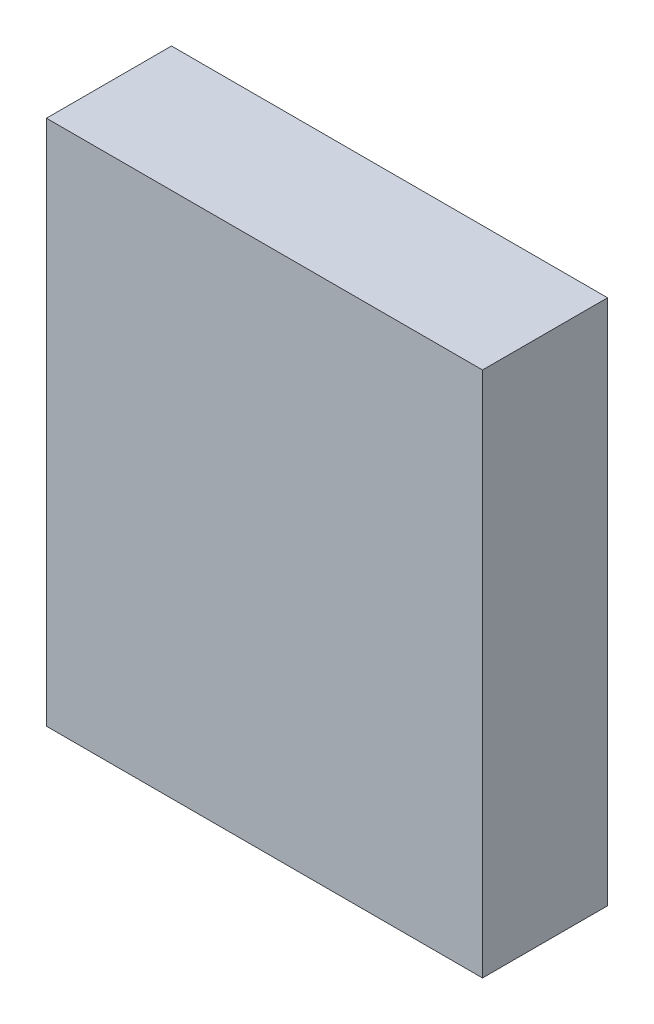
ISO-10303-21;
HEADER;
FILE_DESCRIPTION(('STEP AP214'),'2;1');
FILE_NAME('part.step','',(''),(''),'','','');
FILE_SCHEMA(('AUTOMOTIVE_DESIGN { 1 0 10303 214 1 1 1 1 }'));
ENDSEC;
DATA;
#1=APPLICATION_CONTEXT('core data for automotive mechanical design processes');
#2=APPLICATION_PROTOCOL_DEFINITION('international standard','automotive_design',2000,#1);
#3=PRODUCT_CONTEXT('',#1,'mechanical');
#4=PRODUCT('Part','Part','',(#3));
#5=PRODUCT_RELATED_PRODUCT_CATEGORY('part','',(#4));
#6=PRODUCT_DEFINITION_FORMATION('','',#4);
#7=PRODUCT_DEFINITION_CONTEXT('part definition',#1,'design');
#8=PRODUCT_DEFINITION('design','',#6,#7);
#9=PRODUCT_DEFINITION_SHAPE('','',#8);
#10=(LENGTH_UNIT() NAMED_UNIT(*) SI_UNIT(.MILLI.,.METRE.));
#11=(NAMED_UNIT(*) PLANE_ANGLE_UNIT() SI_UNIT($,.RADIAN.));
#12=(NAMED_UNIT(*) SI_UNIT($,.STERADIAN.) SOLID_ANGLE_UNIT());
#13=UNCERTAINTY_MEASURE_WITH_UNIT(LENGTH_MEASURE(1.E-05),#10,'distance_accuracy_value','');
#14=(GEOMETRIC_REPRESENTATION_CONTEXT(3) GLOBAL_UNCERTAINTY_ASSIGNED_CONTEXT((#13)) GLOBAL_UNIT_ASSIGNED_CONTEXT((#10,
#11,#12)) REPRESENTATION_CONTEXT('',''));
#15=CARTESIAN_POINT('',(0.,0.,0.));
#16=DIRECTION('',(0.,0.,1.));
#17=DIRECTION('',(1.,0.,0.));
#18=AXIS2_PLACEMENT_3D('',#15,#16,#17);
#19=CARTESIAN_POINT('',(1.32500116,1.59999934,0.76000102));
#20=DIRECTION('',(0.,0.,1.));
#21=DIRECTION('',(1.,0.,0.));
#22=AXIS2_PLACEMENT_3D('',#19,#20,#21);
#23=PLANE('',#22);
#24=DIRECTION('',(0.,-1.,0.));
#25=VECTOR('',#24,1.);
#26=CARTESIAN_POINT('',(1.32500116,1.59999934,0.76000102));
#27=LINE('',#26,#25);
#28=CARTESIAN_POINT('',(1.32500116,1.59999934,0.76000102));
#29=VERTEX_POINT('',#28);
#30=CARTESIAN_POINT('',(1.32500116,-1.59999934,0.76000102));
#31=VERTEX_POINT('',#30);
#32=EDGE_CURVE('E82',#29,#31,#27,.T.);
#33=ORIENTED_EDGE('',*,*,#32,.F.);
#34=DIRECTION('',(1.,0.,0.));
#35=VECTOR('',#34,1.);
#36=CARTESIAN_POINT('',(-1.32499862,1.59999934,0.76000102));
#37=LINE('',#36,#35);
#38=CARTESIAN_POINT('',(-1.32499862,1.59999934,0.76000102));
#39=VERTEX_POINT('',#38);
#40=EDGE_CURVE('E28',#39,#29,#37,.T.);
#41=ORIENTED_EDGE('',*,*,#40,.F.);
#42=DIRECTION('',(0.,1.,0.));
#43=VECTOR('',#42,1.);
#44=CARTESIAN_POINT('',(-1.32499862,-1.59999934,0.76000102));
#45=LINE('',#44,#43);
#46=CARTESIAN_POINT('',(-1.32499862,-1.59999934,0.76000102));
#47=VERTEX_POINT('',#46);
#48=EDGE_CURVE('E95',#47,#39,#45,.T.);
#49=ORIENTED_EDGE('',*,*,#48,.F.);
#50=DIRECTION('',(-1.,0.,0.));
#51=VECTOR('',#50,1.);
#52=CARTESIAN_POINT('',(1.32500116,-1.59999934,0.76000102));
#53=LINE('',#52,#51);
#54=EDGE_CURVE('E77',#31,#47,#53,.T.);
#55=ORIENTED_EDGE('',*,*,#54,.F.);
#56=EDGE_LOOP('',(#33,#41,#49,#55));
#57=FACE_BOUND('',#56,.T.);
#58=ADVANCED_FACE('F17',(#57),#23,.T.);
#59=CARTESIAN_POINT('',(1.32500116,1.59999934,0.));
#60=DIRECTION('',(0.,0.,1.));
#61=DIRECTION('',(1.,0.,0.));
#62=AXIS2_PLACEMENT_3D('',#59,#60,#61);
#63=PLANE('',#62);
#64=DIRECTION('',(0.,-1.,0.));
#65=VECTOR('',#64,1.);
#66=CARTESIAN_POINT('',(1.32500116,1.59999934,0.));
#67=LINE('',#66,#65);
#68=CARTESIAN_POINT('',(1.32500116,1.59999934,0.));
#69=VERTEX_POINT('',#68);
#70=CARTESIAN_POINT('',(1.32500116,-1.59999934,0.));
#71=VERTEX_POINT('',#70);
#72=EDGE_CURVE('E67',#69,#71,#67,.T.);
#73=ORIENTED_EDGE('',*,*,#72,.T.);
#74=DIRECTION('',(-1.,0.,0.));
#75=VECTOR('',#74,1.);
#76=CARTESIAN_POINT('',(1.32500116,-1.59999934,0.));
#77=LINE('',#76,#75);
#78=CARTESIAN_POINT('',(-1.32499862,-1.59999934,0.));
#79=VERTEX_POINT('',#78);
#80=EDGE_CURVE('E99',#71,#79,#77,.T.);
#81=ORIENTED_EDGE('',*,*,#80,.T.);
#82=DIRECTION('',(0.,1.,0.));
#83=VECTOR('',#82,1.);
#84=CARTESIAN_POINT('',(-1.32499862,-1.59999934,0.));
#85=LINE('',#84,#83);
#86=CARTESIAN_POINT('',(-1.32499862,1.59999934,0.));
#87=VERTEX_POINT('',#86);
#88=EDGE_CURVE('E21',#79,#87,#85,.T.);
#89=ORIENTED_EDGE('',*,*,#88,.T.);
#90=DIRECTION('',(1.,0.,0.));
#91=VECTOR('',#90,1.);
#92=CARTESIAN_POINT('',(-1.32499862,1.59999934,0.));
#93=LINE('',#92,#91);
#94=EDGE_CURVE('E11',#87,#69,#93,.T.);
#95=ORIENTED_EDGE('',*,*,#94,.T.);
#96=EDGE_LOOP('',(#73,#81,#89,#95));
#97=FACE_BOUND('',#96,.T.);
#98=ADVANCED_FACE('F65',(#97),#63,.F.);
#99=CARTESIAN_POINT('',(-1.32499862,1.59999934,0.));
#100=DIRECTION('',(0.,1.,0.));
#101=DIRECTION('',(1.,0.,0.));
#102=AXIS2_PLACEMENT_3D('',#99,#100,#101);
#103=PLANE('',#102);
#104=DIRECTION('',(0.,0.,1.));
#105=VECTOR('',#104,1.);
#106=CARTESIAN_POINT('',(-1.32499862,1.59999934,0.));
#107=LINE('',#106,#105);
#108=EDGE_CURVE('E90',#87,#39,#107,.T.);
#109=ORIENTED_EDGE('',*,*,#108,.T.);
#110=ORIENTED_EDGE('',*,*,#40,.T.);
#111=DIRECTION('',(0.,0.,1.));
#112=VECTOR('',#111,1.);
#113=CARTESIAN_POINT('',(1.32500116,1.59999934,0.));
#114=LINE('',#113,#112);
#115=EDGE_CURVE('E73',#69,#29,#114,.T.);
#116=ORIENTED_EDGE('',*,*,#115,.F.);
#117=ORIENTED_EDGE('',*,*,#94,.F.);
#118=EDGE_LOOP('',(#109,#110,#116,#117));
#119=FACE_BOUND('',#118,.T.);
#120=ADVANCED_FACE('F79',(#119),#103,.T.);
#121=CARTESIAN_POINT('',(-1.32499862,-1.59999934,0.));
#122=DIRECTION('',(-1.,0.,0.));
#123=DIRECTION('',(0.,0.,1.));
#124=AXIS2_PLACEMENT_3D('',#121,#122,#123);
#125=PLANE('',#124);
#126=DIRECTION('',(0.,0.,1.));
#127=VECTOR('',#126,1.);
#128=CARTESIAN_POINT('',(-1.32499862,-1.59999934,0.));
#129=LINE('',#128,#127);
#130=EDGE_CURVE('E94',#79,#47,#129,.T.);
#131=ORIENTED_EDGE('',*,*,#130,.T.);
#132=ORIENTED_EDGE('',*,*,#48,.T.);
#133=ORIENTED_EDGE('',*,*,#108,.F.);
#134=ORIENTED_EDGE('',*,*,#88,.F.);
#135=EDGE_LOOP('',(#131,#132,#133,#134));
#136=FACE_BOUND('',#135,.T.);
#137=ADVANCED_FACE('F114',(#136),#125,.T.);
#138=CARTESIAN_POINT('',(1.32500116,-1.59999934,0.));
#139=DIRECTION('',(0.,-1.,0.));
#140=DIRECTION('',(0.,0.,-1.));
#141=AXIS2_PLACEMENT_3D('',#138,#139,#140);
#142=PLANE('',#141);
#143=DIRECTION('',(0.,0.,1.));
#144=VECTOR('',#143,1.);
#145=CARTESIAN_POINT('',(1.32500116,-1.59999934,0.));
#146=LINE('',#145,#144);
#147=EDGE_CURVE('E75',#71,#31,#146,.T.);
#148=ORIENTED_EDGE('',*,*,#147,.T.);
#149=ORIENTED_EDGE('',*,*,#54,.T.);
#150=ORIENTED_EDGE('',*,*,#130,.F.);
#151=ORIENTED_EDGE('',*,*,#80,.F.);
#152=EDGE_LOOP('',(#148,#149,#150,#151));
#153=FACE_BOUND('',#152,.T.);
#154=ADVANCED_FACE('F126',(#153),#142,.T.);
#155=CARTESIAN_POINT('',(1.32500116,1.59999934,0.));
#156=DIRECTION('',(1.,0.,0.));
#157=DIRECTION('',(0.,1.,0.));
#158=AXIS2_PLACEMENT_3D('',#155,#156,#157);
#159=PLANE('',#158);
#160=ORIENTED_EDGE('',*,*,#115,.T.);
#161=ORIENTED_EDGE('',*,*,#32,.T.);
#162=ORIENTED_EDGE('',*,*,#147,.F.);
#163=ORIENTED_EDGE('',*,*,#72,.F.);
#164=EDGE_LOOP('',(#160,#161,#162,#163));
#165=FACE_BOUND('',#164,.T.);
#166=ADVANCED_FACE('F19',(#165),#159,.T.);
#167=CLOSED_SHELL('',(#58,#98,#120,#137,#154,#166));
#168=MANIFOLD_SOLID_BREP('B1',#167);
#169=ADVANCED_BREP_SHAPE_REPRESENTATION('',(#18,#168),#14);
#170=SHAPE_DEFINITION_REPRESENTATION(#9,#169);
ENDSEC;
END-ISO-10303-21;
